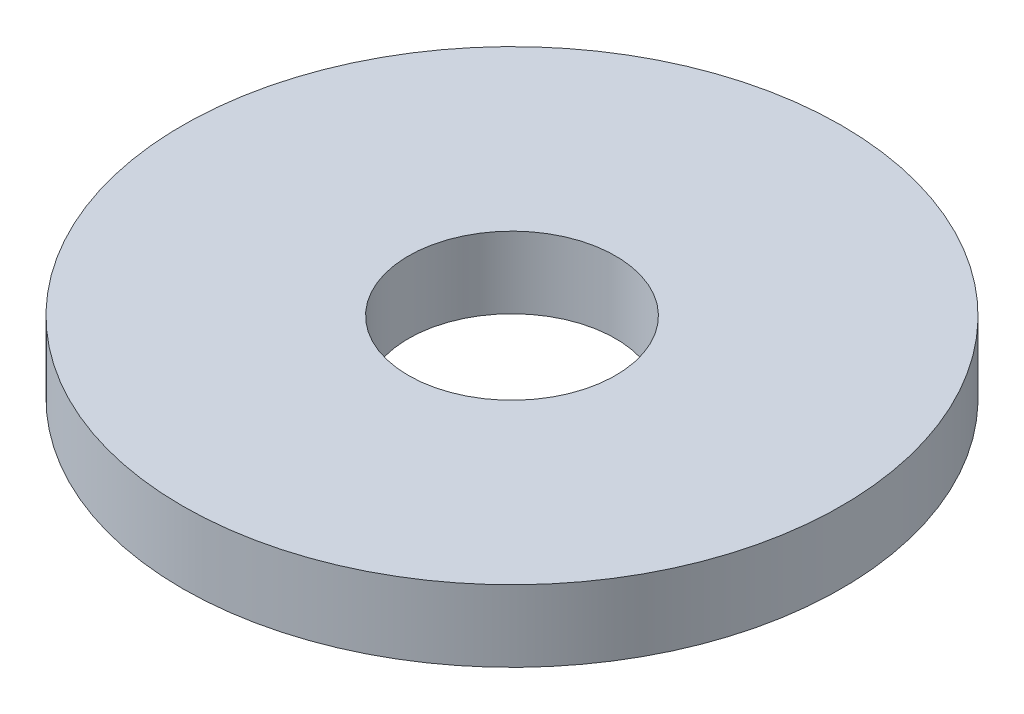
ISO-10303-21;
HEADER;
FILE_DESCRIPTION(('STEP AP214'),'2;1');
FILE_NAME('part.step','',(''),(''),'','','');
FILE_SCHEMA(('AUTOMOTIVE_DESIGN { 1 0 10303 214 1 1 1 1 }'));
ENDSEC;
DATA;
#1=APPLICATION_CONTEXT('core data for automotive mechanical design processes');
#2=APPLICATION_PROTOCOL_DEFINITION('international standard','automotive_design',2000,#1);
#3=PRODUCT_CONTEXT('',#1,'mechanical');
#4=PRODUCT('Part','Part','',(#3));
#5=PRODUCT_RELATED_PRODUCT_CATEGORY('part','',(#4));
#6=PRODUCT_DEFINITION_FORMATION('','',#4);
#7=PRODUCT_DEFINITION_CONTEXT('part definition',#1,'design');
#8=PRODUCT_DEFINITION('design','',#6,#7);
#9=PRODUCT_DEFINITION_SHAPE('','',#8);
#10=(LENGTH_UNIT() NAMED_UNIT(*) SI_UNIT(.MILLI.,.METRE.));
#11=(NAMED_UNIT(*) PLANE_ANGLE_UNIT() SI_UNIT($,.RADIAN.));
#12=(NAMED_UNIT(*) SI_UNIT($,.STERADIAN.) SOLID_ANGLE_UNIT());
#13=UNCERTAINTY_MEASURE_WITH_UNIT(LENGTH_MEASURE(1.E-05),#10,'distance_accuracy_value','');
#14=(GEOMETRIC_REPRESENTATION_CONTEXT(3) GLOBAL_UNCERTAINTY_ASSIGNED_CONTEXT((#13)) GLOBAL_UNIT_ASSIGNED_CONTEXT((#10,
#11,#12)) REPRESENTATION_CONTEXT('',''));
#15=CARTESIAN_POINT('',(0.,0.,0.));
#16=DIRECTION('',(0.,0.,1.));
#17=DIRECTION('',(1.,0.,0.));
#18=AXIS2_PLACEMENT_3D('',#15,#16,#17);
#19=CARTESIAN_POINT('',(0.,19.,0.));
#20=DIRECTION('',(0.,-1.,0.));
#21=DIRECTION('',(0.,0.,-1.));
#22=AXIS2_PLACEMENT_3D('',#19,#20,#21);
#23=CYLINDRICAL_SURFACE('',#22,87.5);
#24=CARTESIAN_POINT('',(0.,19.,0.));
#25=DIRECTION('',(0.,1.,0.));
#26=DIRECTION('',(0.,0.,1.));
#27=AXIS2_PLACEMENT_3D('',#24,#25,#26);
#28=CIRCLE('',#27,87.5);
#29=CARTESIAN_POINT('',(0.,19.,87.5));
#30=VERTEX_POINT('',#29);
#31=EDGE_CURVE('E10',#30,#30,#28,.T.);
#32=ORIENTED_EDGE('',*,*,#31,.F.);
#33=EDGE_LOOP('',(#32));
#34=FACE_BOUND('',#33,.T.);
#35=CARTESIAN_POINT('',(0.,0.,0.));
#36=DIRECTION('',(0.,1.,0.));
#37=DIRECTION('',(0.,0.,1.));
#38=AXIS2_PLACEMENT_3D('',#35,#36,#37);
#39=CIRCLE('',#38,87.5);
#40=CARTESIAN_POINT('',(0.,0.,87.5));
#41=VERTEX_POINT('',#40);
#42=EDGE_CURVE('E37',#41,#41,#39,.T.);
#43=ORIENTED_EDGE('',*,*,#42,.T.);
#44=EDGE_LOOP('',(#43));
#45=FACE_BOUND('',#44,.T.);
#46=ADVANCED_FACE('F40',(#34,#45),#23,.T.);
#47=CARTESIAN_POINT('',(0.,19.,0.));
#48=DIRECTION('',(0.,1.,0.));
#49=DIRECTION('',(0.,0.,1.));
#50=AXIS2_PLACEMENT_3D('',#47,#48,#49);
#51=PLANE('',#50);
#52=CARTESIAN_POINT('',(0.,19.,0.));
#53=DIRECTION('',(0.,1.,0.));
#54=DIRECTION('',(0.,0.,1.));
#55=AXIS2_PLACEMENT_3D('',#52,#53,#54);
#56=CIRCLE('',#55,27.5);
#57=CARTESIAN_POINT('',(0.,19.,27.5));
#58=VERTEX_POINT('',#57);
#59=EDGE_CURVE('E50',#58,#58,#56,.T.);
#60=ORIENTED_EDGE('',*,*,#59,.F.);
#61=EDGE_LOOP('',(#60));
#62=FACE_BOUND('',#61,.T.);
#63=ORIENTED_EDGE('',*,*,#31,.T.);
#64=EDGE_LOOP('',(#63));
#65=FACE_BOUND('',#64,.T.);
#66=ADVANCED_FACE('F59',(#62,#65),#51,.T.);
#67=CARTESIAN_POINT('',(0.,0.,0.));
#68=DIRECTION('',(0.,1.,0.));
#69=DIRECTION('',(0.,0.,1.));
#70=AXIS2_PLACEMENT_3D('',#67,#68,#69);
#71=PLANE('',#70);
#72=CARTESIAN_POINT('',(0.,0.,0.));
#73=DIRECTION('',(0.,1.,0.));
#74=DIRECTION('',(0.,0.,1.));
#75=AXIS2_PLACEMENT_3D('',#72,#73,#74);
#76=CIRCLE('',#75,27.5);
#77=CARTESIAN_POINT('',(0.,0.,27.5));
#78=VERTEX_POINT('',#77);
#79=EDGE_CURVE('E47',#78,#78,#76,.T.);
#80=ORIENTED_EDGE('',*,*,#79,.T.);
#81=EDGE_LOOP('',(#80));
#82=FACE_BOUND('',#81,.T.);
#83=ORIENTED_EDGE('',*,*,#42,.F.);
#84=EDGE_LOOP('',(#83));
#85=FACE_BOUND('',#84,.T.);
#86=ADVANCED_FACE('F58',(#82,#85),#71,.F.);
#87=CARTESIAN_POINT('',(0.,19.,0.));
#88=DIRECTION('',(0.,-1.,0.));
#89=DIRECTION('',(0.,0.,-1.));
#90=AXIS2_PLACEMENT_3D('',#87,#88,#89);
#91=CYLINDRICAL_SURFACE('',#90,27.5);
#92=ORIENTED_EDGE('',*,*,#59,.T.);
#93=EDGE_LOOP('',(#92));
#94=FACE_BOUND('',#93,.T.);
#95=ORIENTED_EDGE('',*,*,#79,.F.);
#96=EDGE_LOOP('',(#95));
#97=FACE_BOUND('',#96,.T.);
#98=ADVANCED_FACE('F54',(#94,#97),#91,.F.);
#99=CLOSED_SHELL('',(#46,#66,#86,#98));
#100=MANIFOLD_SOLID_BREP('B2',#99);
#101=ADVANCED_BREP_SHAPE_REPRESENTATION('',(#18,#100),#14);
#102=SHAPE_DEFINITION_REPRESENTATION(#9,#101);
ENDSEC;
END-ISO-10303-21;
